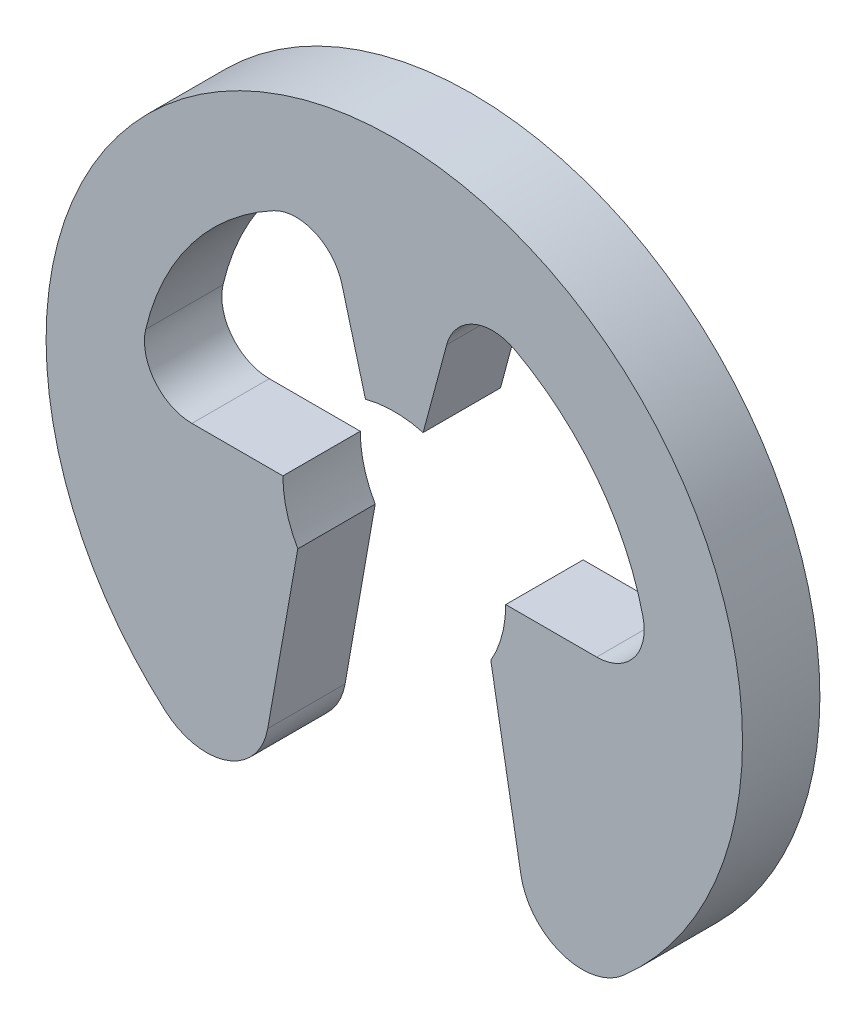
ISO-10303-21;
HEADER;
FILE_DESCRIPTION(('STEP AP214'),'2;1');
FILE_NAME('part.step','',(''),(''),'','','');
FILE_SCHEMA(('AUTOMOTIVE_DESIGN { 1 0 10303 214 1 1 1 1 }'));
ENDSEC;
DATA;
#1=APPLICATION_CONTEXT('core data for automotive mechanical design processes');
#2=APPLICATION_PROTOCOL_DEFINITION('international standard','automotive_design',2000,#1);
#3=PRODUCT_CONTEXT('',#1,'mechanical');
#4=PRODUCT('Part','Part','',(#3));
#5=PRODUCT_RELATED_PRODUCT_CATEGORY('part','',(#4));
#6=PRODUCT_DEFINITION_FORMATION('','',#4);
#7=PRODUCT_DEFINITION_CONTEXT('part definition',#1,'design');
#8=PRODUCT_DEFINITION('design','',#6,#7);
#9=PRODUCT_DEFINITION_SHAPE('','',#8);
#10=(LENGTH_UNIT() NAMED_UNIT(*) SI_UNIT(.MILLI.,.METRE.));
#11=(NAMED_UNIT(*) PLANE_ANGLE_UNIT() SI_UNIT($,.RADIAN.));
#12=(NAMED_UNIT(*) SI_UNIT($,.STERADIAN.) SOLID_ANGLE_UNIT());
#13=UNCERTAINTY_MEASURE_WITH_UNIT(LENGTH_MEASURE(1.E-05),#10,'distance_accuracy_value','');
#14=(GEOMETRIC_REPRESENTATION_CONTEXT(3) GLOBAL_UNCERTAINTY_ASSIGNED_CONTEXT((#13)) GLOBAL_UNIT_ASSIGNED_CONTEXT((#10,
#11,#12)) REPRESENTATION_CONTEXT('',''));
#15=CARTESIAN_POINT('',(0.,0.,0.));
#16=DIRECTION('',(0.,0.,1.));
#17=DIRECTION('',(1.,0.,0.));
#18=AXIS2_PLACEMENT_3D('',#15,#16,#17);
#19=CARTESIAN_POINT('',(0.653783220953245,0.15345,-0.25));
#20=DIRECTION('',(0.,0.,1.));
#21=DIRECTION('',(1.,0.,0.));
#22=AXIS2_PLACEMENT_3D('',#19,#20,#21);
#23=CYLINDRICAL_SURFACE('',#22,0.15345);
#24=CARTESIAN_POINT('',(0.653783220953245,0.15345,0.));
#25=DIRECTION('',(0.,0.,-1.));
#26=DIRECTION('',(1.,0.,0.));
#27=AXIS2_PLACEMENT_3D('',#24,#25,#26);
#28=CIRCLE('',#27,0.15345);
#29=CARTESIAN_POINT('',(0.803173490114552,0.188513513513514,0.));
#30=VERTEX_POINT('',#29);
#31=CARTESIAN_POINT('',(0.653783220953245,0.,0.));
#32=VERTEX_POINT('',#31);
#33=EDGE_CURVE('E189',#30,#32,#28,.T.);
#34=ORIENTED_EDGE('',*,*,#33,.F.);
#35=DIRECTION('',(0.,0.,1.));
#36=VECTOR('',#35,1.);
#37=CARTESIAN_POINT('',(0.803173490114552,0.188513513513514,-0.25));
#38=LINE('',#37,#36);
#39=CARTESIAN_POINT('',(0.803173490114552,0.188513513513514,-0.25));
#40=VERTEX_POINT('',#39);
#41=EDGE_CURVE('E11',#40,#30,#38,.T.);
#42=ORIENTED_EDGE('',*,*,#41,.F.);
#43=CARTESIAN_POINT('',(0.653783220953245,0.15345,-0.25));
#44=DIRECTION('',(0.,0.,-1.));
#45=DIRECTION('',(1.,0.,0.));
#46=AXIS2_PLACEMENT_3D('',#43,#44,#45);
#47=CIRCLE('',#46,0.15345);
#48=CARTESIAN_POINT('',(0.653783220953245,0.,-0.25));
#49=VERTEX_POINT('',#48);
#50=EDGE_CURVE('E239',#40,#49,#47,.T.);
#51=ORIENTED_EDGE('',*,*,#50,.T.);
#52=DIRECTION('',(0.,0.,1.));
#53=VECTOR('',#52,1.);
#54=CARTESIAN_POINT('',(0.653783220953245,0.,-0.25));
#55=LINE('',#54,#53);
#56=EDGE_CURVE('E35',#49,#32,#55,.T.);
#57=ORIENTED_EDGE('',*,*,#56,.T.);
#58=EDGE_LOOP('',(#34,#42,#51,#57));
#59=FACE_BOUND('',#58,.T.);
#60=ADVANCED_FACE('F32',(#59),#23,.F.);
#61=CARTESIAN_POINT('',(0.,0.,-0.25));
#62=DIRECTION('',(0.,0.,1.));
#63=DIRECTION('',(1.,0.,0.));
#64=AXIS2_PLACEMENT_3D('',#61,#62,#63);
#65=CYLINDRICAL_SURFACE('',#64,0.825);
#66=CARTESIAN_POINT('',(0.,0.,0.));
#67=DIRECTION('',(0.,0.,-1.));
#68=DIRECTION('',(1.,0.,0.));
#69=AXIS2_PLACEMENT_3D('',#66,#67,#68);
#70=CIRCLE('',#69,0.825);
#71=CARTESIAN_POINT('',(0.389966667070304,0.727015129535885,0.));
#72=VERTEX_POINT('',#71);
#73=EDGE_CURVE('E237',#72,#30,#70,.T.);
#74=ORIENTED_EDGE('',*,*,#73,.F.);
#75=DIRECTION('',(0.,0.,1.));
#76=VECTOR('',#75,1.);
#77=CARTESIAN_POINT('',(0.389966667070304,0.727015129535885,-0.25));
#78=LINE('',#77,#76);
#79=CARTESIAN_POINT('',(0.389966667070304,0.727015129535885,-0.25));
#80=VERTEX_POINT('',#79);
#81=EDGE_CURVE('E41',#80,#72,#78,.T.);
#82=ORIENTED_EDGE('',*,*,#81,.F.);
#83=CARTESIAN_POINT('',(0.,0.,-0.25));
#84=DIRECTION('',(0.,0.,-1.));
#85=DIRECTION('',(1.,0.,0.));
#86=AXIS2_PLACEMENT_3D('',#83,#84,#85);
#87=CIRCLE('',#86,0.825);
#88=EDGE_CURVE('E179',#80,#40,#87,.T.);
#89=ORIENTED_EDGE('',*,*,#88,.T.);
#90=ORIENTED_EDGE('',*,*,#41,.T.);
#91=EDGE_LOOP('',(#74,#82,#89,#90));
#92=FACE_BOUND('',#91,.T.);
#93=ADVANCED_FACE('F271',(#92),#65,.F.);
#94=CARTESIAN_POINT('',(0.317432866995227,0.591790315442209,-0.25));
#95=DIRECTION('',(0.,0.,1.));
#96=DIRECTION('',(1.,0.,0.));
#97=AXIS2_PLACEMENT_3D('',#94,#95,#96);
#98=CYLINDRICAL_SURFACE('',#97,0.153450000000001);
#99=CARTESIAN_POINT('',(0.317432866995227,0.591790315442209,0.));
#100=DIRECTION('',(0.,0.,-1.));
#101=DIRECTION('',(1.,0.,0.));
#102=AXIS2_PLACEMENT_3D('',#99,#100,#101);
#103=CIRCLE('',#102,0.153450000000001);
#104=CARTESIAN_POINT('',(0.169211548951169,0.63150609791319,0.));
#105=VERTEX_POINT('',#104);
#106=EDGE_CURVE('E166',#105,#72,#103,.T.);
#107=ORIENTED_EDGE('',*,*,#106,.F.);
#108=DIRECTION('',(0.,0.,1.));
#109=VECTOR('',#108,1.);
#110=CARTESIAN_POINT('',(0.169211548951169,0.63150609791319,-0.25));
#111=LINE('',#110,#109);
#112=CARTESIAN_POINT('',(0.169211548951169,0.63150609791319,-0.25));
#113=VERTEX_POINT('',#112);
#114=EDGE_CURVE('E161',#113,#105,#111,.T.);
#115=ORIENTED_EDGE('',*,*,#114,.F.);
#116=CARTESIAN_POINT('',(0.317432866995227,0.591790315442209,-0.25));
#117=DIRECTION('',(0.,0.,-1.));
#118=DIRECTION('',(1.,0.,0.));
#119=AXIS2_PLACEMENT_3D('',#116,#117,#118);
#120=CIRCLE('',#119,0.153450000000001);
#121=EDGE_CURVE('E164',#113,#80,#120,.T.);
#122=ORIENTED_EDGE('',*,*,#121,.T.);
#123=ORIENTED_EDGE('',*,*,#81,.T.);
#124=EDGE_LOOP('',(#107,#115,#122,#123));
#125=FACE_BOUND('',#124,.T.);
#126=ADVANCED_FACE('F163',(#125),#98,.F.);
#127=CARTESIAN_POINT('',(0.0931748562369079,0.347733297464065,-0.25));
#128=DIRECTION('',(0.965925826289068,-0.258819045102522,0.));
#129=DIRECTION('',(0.258819045102522,0.965925826289068,0.));
#130=AXIS2_PLACEMENT_3D('',#127,#128,#129);
#131=PLANE('',#130);
#132=DIRECTION('',(0.258819045102522,0.965925826289068,0.));
#133=VECTOR('',#132,1.);
#134=CARTESIAN_POINT('',(0.0931748562369079,0.347733297464065,0.));
#135=LINE('',#134,#133);
#136=CARTESIAN_POINT('',(0.0931748562369079,0.347733297464065,0.));
#137=VERTEX_POINT('',#136);
#138=EDGE_CURVE('E234',#137,#105,#135,.T.);
#139=ORIENTED_EDGE('',*,*,#138,.F.);
#140=DIRECTION('',(0.,0.,1.));
#141=VECTOR('',#140,1.);
#142=CARTESIAN_POINT('',(0.0931748562369079,0.347733297464065,-0.25));
#143=LINE('',#142,#141);
#144=CARTESIAN_POINT('',(0.0931748562369079,0.347733297464065,-0.25));
#145=VERTEX_POINT('',#144);
#146=EDGE_CURVE('E171',#145,#137,#143,.T.);
#147=ORIENTED_EDGE('',*,*,#146,.F.);
#148=DIRECTION('',(0.258819045102522,0.965925826289068,0.));
#149=VECTOR('',#148,1.);
#150=CARTESIAN_POINT('',(0.0931748562369079,0.347733297464065,-0.25));
#151=LINE('',#150,#149);
#152=EDGE_CURVE('E177',#145,#113,#151,.T.);
#153=ORIENTED_EDGE('',*,*,#152,.T.);
#154=ORIENTED_EDGE('',*,*,#114,.T.);
#155=EDGE_LOOP('',(#139,#147,#153,#154));
#156=FACE_BOUND('',#155,.T.);
#157=ADVANCED_FACE('F181',(#156),#131,.T.);
#158=CARTESIAN_POINT('',(0.,0.,-0.25));
#159=DIRECTION('',(0.,0.,1.));
#160=DIRECTION('',(1.,0.,0.));
#161=AXIS2_PLACEMENT_3D('',#158,#159,#160);
#162=CYLINDRICAL_SURFACE('',#161,0.36);
#163=CARTESIAN_POINT('',(0.,0.,0.));
#164=DIRECTION('',(0.,0.,-1.));
#165=DIRECTION('',(-1.,0.,0.));
#166=AXIS2_PLACEMENT_3D('',#163,#164,#165);
#167=CIRCLE('',#166,0.36);
#168=CARTESIAN_POINT('',(-0.0931748562369079,0.347733297464065,0.));
#169=VERTEX_POINT('',#168);
#170=EDGE_CURVE('E231',#169,#137,#167,.T.);
#171=ORIENTED_EDGE('',*,*,#170,.F.);
#172=DIRECTION('',(0.,0.,1.));
#173=VECTOR('',#172,1.);
#174=CARTESIAN_POINT('',(-0.0931748562369079,0.347733297464065,-0.25));
#175=LINE('',#174,#173);
#176=CARTESIAN_POINT('',(-0.0931748562369079,0.347733297464065,-0.25));
#177=VERTEX_POINT('',#176);
#178=EDGE_CURVE('E243',#177,#169,#175,.T.);
#179=ORIENTED_EDGE('',*,*,#178,.F.);
#180=CARTESIAN_POINT('',(0.,0.,-0.25));
#181=DIRECTION('',(0.,0.,-1.));
#182=DIRECTION('',(-1.,0.,0.));
#183=AXIS2_PLACEMENT_3D('',#180,#181,#182);
#184=CIRCLE('',#183,0.36);
#185=EDGE_CURVE('E182',#177,#145,#184,.T.);
#186=ORIENTED_EDGE('',*,*,#185,.T.);
#187=ORIENTED_EDGE('',*,*,#146,.T.);
#188=EDGE_LOOP('',(#171,#179,#186,#187));
#189=FACE_BOUND('',#188,.T.);
#190=ADVANCED_FACE('F284',(#189),#162,.F.);
#191=CARTESIAN_POINT('',(-0.0931748562369079,0.347733297464065,-0.25));
#192=DIRECTION('',(-0.965925826289068,-0.258819045102522,0.));
#193=DIRECTION('',(0.258819045102522,-0.965925826289068,0.));
#194=AXIS2_PLACEMENT_3D('',#191,#192,#193);
#195=PLANE('',#194);
#196=DIRECTION('',(0.258819045102522,-0.965925826289068,0.));
#197=VECTOR('',#196,1.);
#198=CARTESIAN_POINT('',(-0.0931748562369079,0.347733297464065,0.));
#199=LINE('',#198,#197);
#200=CARTESIAN_POINT('',(-0.16921154895117,0.63150609791319,0.));
#201=VERTEX_POINT('',#200);
#202=EDGE_CURVE('E228',#201,#169,#199,.T.);
#203=ORIENTED_EDGE('',*,*,#202,.F.);
#204=DIRECTION('',(0.,0.,1.));
#205=VECTOR('',#204,1.);
#206=CARTESIAN_POINT('',(-0.16921154895117,0.63150609791319,-0.25));
#207=LINE('',#206,#205);
#208=CARTESIAN_POINT('',(-0.16921154895117,0.63150609791319,-0.25));
#209=VERTEX_POINT('',#208);
#210=EDGE_CURVE('E245',#209,#201,#207,.T.);
#211=ORIENTED_EDGE('',*,*,#210,.F.);
#212=DIRECTION('',(0.258819045102522,-0.965925826289068,0.));
#213=VECTOR('',#212,1.);
#214=CARTESIAN_POINT('',(-0.0931748562369079,0.347733297464065,-0.25));
#215=LINE('',#214,#213);
#216=EDGE_CURVE('E184',#209,#177,#215,.T.);
#217=ORIENTED_EDGE('',*,*,#216,.T.);
#218=ORIENTED_EDGE('',*,*,#178,.T.);
#219=EDGE_LOOP('',(#203,#211,#217,#218));
#220=FACE_BOUND('',#219,.T.);
#221=ADVANCED_FACE('F287',(#220),#195,.T.);
#222=CARTESIAN_POINT('',(-0.317432866995227,0.591790315442209,-0.25));
#223=DIRECTION('',(0.,0.,1.));
#224=DIRECTION('',(1.,0.,0.));
#225=AXIS2_PLACEMENT_3D('',#222,#223,#224);
#226=CYLINDRICAL_SURFACE('',#225,0.153450000000001);
#227=CARTESIAN_POINT('',(-0.317432866995227,0.591790315442209,0.));
#228=DIRECTION('',(0.,0.,-1.));
#229=DIRECTION('',(1.,0.,0.));
#230=AXIS2_PLACEMENT_3D('',#227,#228,#229);
#231=CIRCLE('',#230,0.153450000000001);
#232=CARTESIAN_POINT('',(-0.389966667070303,0.727015129535884,0.));
#233=VERTEX_POINT('',#232);
#234=EDGE_CURVE('E225',#233,#201,#231,.T.);
#235=ORIENTED_EDGE('',*,*,#234,.F.);
#236=DIRECTION('',(0.,0.,1.));
#237=VECTOR('',#236,1.);
#238=CARTESIAN_POINT('',(-0.389966667070303,0.727015129535884,-0.25));
#239=LINE('',#238,#237);
#240=CARTESIAN_POINT('',(-0.389966667070303,0.727015129535884,-0.25));
#241=VERTEX_POINT('',#240);
#242=EDGE_CURVE('E247',#241,#233,#239,.T.);
#243=ORIENTED_EDGE('',*,*,#242,.F.);
#244=CARTESIAN_POINT('',(-0.317432866995227,0.591790315442209,-0.25));
#245=DIRECTION('',(0.,0.,-1.));
#246=DIRECTION('',(1.,0.,0.));
#247=AXIS2_PLACEMENT_3D('',#244,#245,#246);
#248=CIRCLE('',#247,0.153450000000001);
#249=EDGE_CURVE('E495',#241,#209,#248,.T.);
#250=ORIENTED_EDGE('',*,*,#249,.T.);
#251=ORIENTED_EDGE('',*,*,#210,.T.);
#252=EDGE_LOOP('',(#235,#243,#250,#251));
#253=FACE_BOUND('',#252,.T.);
#254=ADVANCED_FACE('F291',(#253),#226,.F.);
#255=CARTESIAN_POINT('',(0.,0.,-0.25));
#256=DIRECTION('',(0.,0.,1.));
#257=DIRECTION('',(1.,0.,0.));
#258=AXIS2_PLACEMENT_3D('',#255,#256,#257);
#259=CYLINDRICAL_SURFACE('',#258,0.824999999999999);
#260=CARTESIAN_POINT('',(0.,0.,0.));
#261=DIRECTION('',(0.,0.,-1.));
#262=DIRECTION('',(1.,0.,0.));
#263=AXIS2_PLACEMENT_3D('',#260,#261,#262);
#264=CIRCLE('',#263,0.824999999999999);
#265=CARTESIAN_POINT('',(-0.803173490114551,0.188513513513514,0.));
#266=VERTEX_POINT('',#265);
#267=EDGE_CURVE('E222',#266,#233,#264,.T.);
#268=ORIENTED_EDGE('',*,*,#267,.F.);
#269=DIRECTION('',(0.,0.,1.));
#270=VECTOR('',#269,1.);
#271=CARTESIAN_POINT('',(-0.803173490114551,0.188513513513514,-0.25));
#272=LINE('',#271,#270);
#273=CARTESIAN_POINT('',(-0.803173490114551,0.188513513513514,-0.25));
#274=VERTEX_POINT('',#273);
#275=EDGE_CURVE('E249',#274,#266,#272,.T.);
#276=ORIENTED_EDGE('',*,*,#275,.F.);
#277=CARTESIAN_POINT('',(0.,0.,-0.25));
#278=DIRECTION('',(0.,0.,-1.));
#279=DIRECTION('',(1.,0.,0.));
#280=AXIS2_PLACEMENT_3D('',#277,#278,#279);
#281=CIRCLE('',#280,0.824999999999999);
#282=EDGE_CURVE('E499',#274,#241,#281,.T.);
#283=ORIENTED_EDGE('',*,*,#282,.T.);
#284=ORIENTED_EDGE('',*,*,#242,.T.);
#285=EDGE_LOOP('',(#268,#276,#283,#284));
#286=FACE_BOUND('',#285,.T.);
#287=ADVANCED_FACE('F295',(#286),#259,.F.);
#288=CARTESIAN_POINT('',(-0.653783220953245,0.153450000000001,-0.25));
#289=DIRECTION('',(0.,0.,1.));
#290=DIRECTION('',(1.,0.,0.));
#291=AXIS2_PLACEMENT_3D('',#288,#289,#290);
#292=CYLINDRICAL_SURFACE('',#291,0.15345);
#293=CARTESIAN_POINT('',(-0.653783220953245,0.153450000000001,0.));
#294=DIRECTION('',(0.,0.,-1.));
#295=DIRECTION('',(1.,0.,0.));
#296=AXIS2_PLACEMENT_3D('',#293,#294,#295);
#297=CIRCLE('',#296,0.15345);
#298=CARTESIAN_POINT('',(-0.653783220953245,0.,0.));
#299=VERTEX_POINT('',#298);
#300=EDGE_CURVE('E219',#299,#266,#297,.T.);
#301=ORIENTED_EDGE('',*,*,#300,.F.);
#302=DIRECTION('',(0.,0.,1.));
#303=VECTOR('',#302,1.);
#304=CARTESIAN_POINT('',(-0.653783220953245,0.,-0.25));
#305=LINE('',#304,#303);
#306=CARTESIAN_POINT('',(-0.653783220953245,0.,-0.25));
#307=VERTEX_POINT('',#306);
#308=EDGE_CURVE('E251',#307,#299,#305,.T.);
#309=ORIENTED_EDGE('',*,*,#308,.F.);
#310=CARTESIAN_POINT('',(-0.653783220953245,0.153450000000001,-0.25));
#311=DIRECTION('',(0.,0.,-1.));
#312=DIRECTION('',(1.,0.,0.));
#313=AXIS2_PLACEMENT_3D('',#310,#311,#312);
#314=CIRCLE('',#313,0.15345);
#315=EDGE_CURVE('E488',#307,#274,#314,.T.);
#316=ORIENTED_EDGE('',*,*,#315,.T.);
#317=ORIENTED_EDGE('',*,*,#275,.T.);
#318=EDGE_LOOP('',(#301,#309,#316,#317));
#319=FACE_BOUND('',#318,.T.);
#320=ADVANCED_FACE('F299',(#319),#292,.F.);
#321=CARTESIAN_POINT('',(-0.36,0.,-0.25));
#322=DIRECTION('',(0.,1.,0.));
#323=DIRECTION('',(0.,0.,1.));
#324=AXIS2_PLACEMENT_3D('',#321,#322,#323);
#325=PLANE('',#324);
#326=DIRECTION('',(-1.,0.,0.));
#327=VECTOR('',#326,1.);
#328=CARTESIAN_POINT('',(-0.36,0.,0.));
#329=LINE('',#328,#327);
#330=CARTESIAN_POINT('',(-0.36,0.,0.));
#331=VERTEX_POINT('',#330);
#332=EDGE_CURVE('E216',#331,#299,#329,.T.);
#333=ORIENTED_EDGE('',*,*,#332,.F.);
#334=DIRECTION('',(0.,0.,1.));
#335=VECTOR('',#334,1.);
#336=CARTESIAN_POINT('',(-0.36,0.,-0.25));
#337=LINE('',#336,#335);
#338=CARTESIAN_POINT('',(-0.36,0.,-0.25));
#339=VERTEX_POINT('',#338);
#340=EDGE_CURVE('E253',#339,#331,#337,.T.);
#341=ORIENTED_EDGE('',*,*,#340,.F.);
#342=DIRECTION('',(-1.,0.,0.));
#343=VECTOR('',#342,1.);
#344=CARTESIAN_POINT('',(-0.36,0.,-0.25));
#345=LINE('',#344,#343);
#346=EDGE_CURVE('E484',#339,#307,#345,.T.);
#347=ORIENTED_EDGE('',*,*,#346,.T.);
#348=ORIENTED_EDGE('',*,*,#308,.T.);
#349=EDGE_LOOP('',(#333,#341,#347,#348));
#350=FACE_BOUND('',#349,.T.);
#351=ADVANCED_FACE('F303',(#350),#325,.T.);
#352=CARTESIAN_POINT('',(0.,0.,-0.25));
#353=DIRECTION('',(0.,0.,1.));
#354=DIRECTION('',(1.,0.,0.));
#355=AXIS2_PLACEMENT_3D('',#352,#353,#354);
#356=CYLINDRICAL_SURFACE('',#355,0.36);
#357=CARTESIAN_POINT('',(0.,0.,0.));
#358=DIRECTION('',(0.,0.,-1.));
#359=DIRECTION('',(1.,0.,0.));
#360=AXIS2_PLACEMENT_3D('',#357,#358,#359);
#361=CIRCLE('',#360,0.36);
#362=CARTESIAN_POINT('',(-0.311769145362398,-0.18,0.));
#363=VERTEX_POINT('',#362);
#364=EDGE_CURVE('E213',#363,#331,#361,.T.);
#365=ORIENTED_EDGE('',*,*,#364,.F.);
#366=DIRECTION('',(0.,0.,1.));
#367=VECTOR('',#366,1.);
#368=CARTESIAN_POINT('',(-0.311769145362398,-0.18,-0.25));
#369=LINE('',#368,#367);
#370=CARTESIAN_POINT('',(-0.311769145362398,-0.18,-0.25));
#371=VERTEX_POINT('',#370);
#372=EDGE_CURVE('E255',#371,#363,#369,.T.);
#373=ORIENTED_EDGE('',*,*,#372,.F.);
#374=CARTESIAN_POINT('',(0.,0.,-0.25));
#375=DIRECTION('',(0.,0.,-1.));
#376=DIRECTION('',(1.,0.,0.));
#377=AXIS2_PLACEMENT_3D('',#374,#375,#376);
#378=CIRCLE('',#377,0.36);
#379=EDGE_CURVE('E505',#371,#339,#378,.T.);
#380=ORIENTED_EDGE('',*,*,#379,.T.);
#381=ORIENTED_EDGE('',*,*,#340,.T.);
#382=EDGE_LOOP('',(#365,#373,#380,#381));
#383=FACE_BOUND('',#382,.T.);
#384=ADVANCED_FACE('F307',(#383),#356,.F.);
#385=CARTESIAN_POINT('',(-0.311769145362397,-0.18,-0.25));
#386=DIRECTION('',(0.984807753012208,-0.17364817766693,0.));
#387=DIRECTION('',(0.17364817766693,0.984807753012208,0.));
#388=AXIS2_PLACEMENT_3D('',#385,#386,#387);
#389=PLANE('',#388);
#390=DIRECTION('',(0.17364817766693,0.984807753012208,0.));
#391=VECTOR('',#390,1.);
#392=CARTESIAN_POINT('',(-0.311769145362397,-0.18,0.));
#393=LINE('',#392,#391);
#394=CARTESIAN_POINT('',(-0.409027602164805,-0.731580117867572,0.));
#395=VERTEX_POINT('',#394);
#396=EDGE_CURVE('E210',#395,#363,#393,.T.);
#397=ORIENTED_EDGE('',*,*,#396,.F.);
#398=DIRECTION('',(0.,0.,1.));
#399=VECTOR('',#398,1.);
#400=CARTESIAN_POINT('',(-0.409027602164805,-0.731580117867572,-0.25));
#401=LINE('',#400,#399);
#402=CARTESIAN_POINT('',(-0.409027602164805,-0.731580117867572,-0.25));
#403=VERTEX_POINT('',#402);
#404=EDGE_CURVE('E257',#403,#395,#401,.T.);
#405=ORIENTED_EDGE('',*,*,#404,.F.);
#406=DIRECTION('',(0.17364817766693,0.984807753012208,0.));
#407=VECTOR('',#406,1.);
#408=CARTESIAN_POINT('',(-0.311769145362397,-0.18,-0.25));
#409=LINE('',#408,#407);
#410=EDGE_CURVE('E477',#403,#371,#409,.T.);
#411=ORIENTED_EDGE('',*,*,#410,.T.);
#412=ORIENTED_EDGE('',*,*,#372,.T.);
#413=EDGE_LOOP('',(#397,#405,#411,#412));
#414=FACE_BOUND('',#413,.T.);
#415=ADVANCED_FACE('F311',(#414),#389,.T.);
#416=CARTESIAN_POINT('',(-0.606973960520261,-0.696676834156518,-0.25));
#417=DIRECTION('',(0.,0.,1.));
#418=DIRECTION('',(1.,0.,0.));
#419=AXIS2_PLACEMENT_3D('',#416,#417,#418);
#420=CYLINDRICAL_SURFACE('',#419,0.201000000000001);
#421=CARTESIAN_POINT('',(-0.606973960520261,-0.696676834156518,0.));
#422=DIRECTION('',(0.,0.,1.));
#423=DIRECTION('',(1.,0.,0.));
#424=AXIS2_PLACEMENT_3D('',#421,#422,#423);
#425=CIRCLE('',#424,0.201000000000001);
#426=CARTESIAN_POINT('',(-0.739010503880188,-0.848226664963294,0.));
#427=VERTEX_POINT('',#426);
#428=EDGE_CURVE('E207',#427,#395,#425,.T.);
#429=ORIENTED_EDGE('',*,*,#428,.F.);
#430=DIRECTION('',(0.,0.,1.));
#431=VECTOR('',#430,1.);
#432=CARTESIAN_POINT('',(-0.739010503880188,-0.848226664963294,-0.25));
#433=LINE('',#432,#431);
#434=CARTESIAN_POINT('',(-0.739010503880188,-0.848226664963294,-0.25));
#435=VERTEX_POINT('',#434);
#436=EDGE_CURVE('E259',#435,#427,#433,.T.);
#437=ORIENTED_EDGE('',*,*,#436,.F.);
#438=CARTESIAN_POINT('',(-0.606973960520261,-0.696676834156518,-0.25));
#439=DIRECTION('',(0.,0.,1.));
#440=DIRECTION('',(1.,0.,0.));
#441=AXIS2_PLACEMENT_3D('',#438,#439,#440);
#442=CIRCLE('',#441,0.201000000000001);
#443=EDGE_CURVE('E473',#435,#403,#442,.T.);
#444=ORIENTED_EDGE('',*,*,#443,.T.);
#445=ORIENTED_EDGE('',*,*,#404,.T.);
#446=EDGE_LOOP('',(#429,#437,#444,#445));
#447=FACE_BOUND('',#446,.T.);
#448=ADVANCED_FACE('F315',(#447),#420,.T.);
#449=CARTESIAN_POINT('',(0.,0.,-0.25));
#450=DIRECTION('',(0.,0.,1.));
#451=DIRECTION('',(1.,0.,0.));
#452=AXIS2_PLACEMENT_3D('',#449,#450,#451);
#453=CYLINDRICAL_SURFACE('',#452,1.125);
#454=CARTESIAN_POINT('',(0.,0.,0.));
#455=DIRECTION('',(0.,0.,1.));
#456=DIRECTION('',(1.,0.,0.));
#457=AXIS2_PLACEMENT_3D('',#454,#455,#456);
#458=CIRCLE('',#457,1.125);
#459=CARTESIAN_POINT('',(0.739010503880187,-0.848226664963294,0.));
#460=VERTEX_POINT('',#459);
#461=EDGE_CURVE('E204',#460,#427,#458,.T.);
#462=ORIENTED_EDGE('',*,*,#461,.F.);
#463=DIRECTION('',(0.,0.,1.));
#464=VECTOR('',#463,1.);
#465=CARTESIAN_POINT('',(0.739010503880187,-0.848226664963294,-0.25));
#466=LINE('',#465,#464);
#467=CARTESIAN_POINT('',(0.739010503880187,-0.848226664963294,-0.25));
#468=VERTEX_POINT('',#467);
#469=EDGE_CURVE('E261',#468,#460,#466,.T.);
#470=ORIENTED_EDGE('',*,*,#469,.F.);
#471=CARTESIAN_POINT('',(0.,0.,-0.25));
#472=DIRECTION('',(0.,0.,1.));
#473=DIRECTION('',(1.,0.,0.));
#474=AXIS2_PLACEMENT_3D('',#471,#472,#473);
#475=CIRCLE('',#474,1.125);
#476=EDGE_CURVE('E509',#468,#435,#475,.T.);
#477=ORIENTED_EDGE('',*,*,#476,.T.);
#478=ORIENTED_EDGE('',*,*,#436,.T.);
#479=EDGE_LOOP('',(#462,#470,#477,#478));
#480=FACE_BOUND('',#479,.T.);
#481=ADVANCED_FACE('F319',(#480),#453,.T.);
#482=CARTESIAN_POINT('',(0.606973960520261,-0.696676834156518,-0.25));
#483=DIRECTION('',(0.,0.,1.));
#484=DIRECTION('',(1.,0.,0.));
#485=AXIS2_PLACEMENT_3D('',#482,#483,#484);
#486=CYLINDRICAL_SURFACE('',#485,0.201000000000001);
#487=CARTESIAN_POINT('',(0.606973960520261,-0.696676834156518,0.));
#488=DIRECTION('',(0.,0.,1.));
#489=DIRECTION('',(1.,0.,0.));
#490=AXIS2_PLACEMENT_3D('',#487,#488,#489);
#491=CIRCLE('',#490,0.201000000000001);
#492=CARTESIAN_POINT('',(0.409027602164806,-0.731580117867572,0.));
#493=VERTEX_POINT('',#492);
#494=EDGE_CURVE('E201',#493,#460,#491,.T.);
#495=ORIENTED_EDGE('',*,*,#494,.F.);
#496=DIRECTION('',(0.,0.,1.));
#497=VECTOR('',#496,1.);
#498=CARTESIAN_POINT('',(0.409027602164806,-0.731580117867572,-0.25));
#499=LINE('',#498,#497);
#500=CARTESIAN_POINT('',(0.409027602164806,-0.731580117867572,-0.25));
#501=VERTEX_POINT('',#500);
#502=EDGE_CURVE('E263',#501,#493,#499,.T.);
#503=ORIENTED_EDGE('',*,*,#502,.F.);
#504=CARTESIAN_POINT('',(0.606973960520261,-0.696676834156518,-0.25));
#505=DIRECTION('',(0.,0.,1.));
#506=DIRECTION('',(1.,0.,0.));
#507=AXIS2_PLACEMENT_3D('',#504,#505,#506);
#508=CIRCLE('',#507,0.201000000000001);
#509=EDGE_CURVE('E466',#501,#468,#508,.T.);
#510=ORIENTED_EDGE('',*,*,#509,.T.);
#511=ORIENTED_EDGE('',*,*,#469,.T.);
#512=EDGE_LOOP('',(#495,#503,#510,#511));
#513=FACE_BOUND('',#512,.T.);
#514=ADVANCED_FACE('F323',(#513),#486,.T.);
#515=CARTESIAN_POINT('',(0.311769145362397,-0.18,-0.25));
#516=DIRECTION('',(-0.984807753012208,-0.17364817766693,0.));
#517=DIRECTION('',(0.17364817766693,-0.984807753012208,0.));
#518=AXIS2_PLACEMENT_3D('',#515,#516,#517);
#519=PLANE('',#518);
#520=DIRECTION('',(0.17364817766693,-0.984807753012208,0.));
#521=VECTOR('',#520,1.);
#522=CARTESIAN_POINT('',(0.311769145362397,-0.18,0.));
#523=LINE('',#522,#521);
#524=CARTESIAN_POINT('',(0.311769145362397,-0.18,0.));
#525=VERTEX_POINT('',#524);
#526=EDGE_CURVE('E198',#525,#493,#523,.T.);
#527=ORIENTED_EDGE('',*,*,#526,.F.);
#528=DIRECTION('',(0.,0.,1.));
#529=VECTOR('',#528,1.);
#530=CARTESIAN_POINT('',(0.311769145362397,-0.18,-0.25));
#531=LINE('',#530,#529);
#532=CARTESIAN_POINT('',(0.311769145362397,-0.18,-0.25));
#533=VERTEX_POINT('',#532);
#534=EDGE_CURVE('E265',#533,#525,#531,.T.);
#535=ORIENTED_EDGE('',*,*,#534,.F.);
#536=DIRECTION('',(0.17364817766693,-0.984807753012208,0.));
#537=VECTOR('',#536,1.);
#538=CARTESIAN_POINT('',(0.311769145362397,-0.18,-0.25));
#539=LINE('',#538,#537);
#540=EDGE_CURVE('E462',#533,#501,#539,.T.);
#541=ORIENTED_EDGE('',*,*,#540,.T.);
#542=ORIENTED_EDGE('',*,*,#502,.T.);
#543=EDGE_LOOP('',(#527,#535,#541,#542));
#544=FACE_BOUND('',#543,.T.);
#545=ADVANCED_FACE('F327',(#544),#519,.T.);
#546=CARTESIAN_POINT('',(0.,0.,-0.25));
#547=DIRECTION('',(0.,0.,1.));
#548=DIRECTION('',(1.,0.,0.));
#549=AXIS2_PLACEMENT_3D('',#546,#547,#548);
#550=CYLINDRICAL_SURFACE('',#549,0.36);
#551=CARTESIAN_POINT('',(0.,0.,0.));
#552=DIRECTION('',(0.,0.,-1.));
#553=DIRECTION('',(1.,0.,0.));
#554=AXIS2_PLACEMENT_3D('',#551,#552,#553);
#555=CIRCLE('',#554,0.36);
#556=CARTESIAN_POINT('',(0.36,0.,0.));
#557=VERTEX_POINT('',#556);
#558=EDGE_CURVE('E195',#557,#525,#555,.T.);
#559=ORIENTED_EDGE('',*,*,#558,.F.);
#560=DIRECTION('',(0.,0.,1.));
#561=VECTOR('',#560,1.);
#562=CARTESIAN_POINT('',(0.36,0.,-0.25));
#563=LINE('',#562,#561);
#564=CARTESIAN_POINT('',(0.36,0.,-0.25));
#565=VERTEX_POINT('',#564);
#566=EDGE_CURVE('E266',#565,#557,#563,.T.);
#567=ORIENTED_EDGE('',*,*,#566,.F.);
#568=CARTESIAN_POINT('',(0.,0.,-0.25));
#569=DIRECTION('',(0.,0.,-1.));
#570=DIRECTION('',(1.,0.,0.));
#571=AXIS2_PLACEMENT_3D('',#568,#569,#570);
#572=CIRCLE('',#571,0.36);
#573=EDGE_CURVE('E513',#565,#533,#572,.T.);
#574=ORIENTED_EDGE('',*,*,#573,.T.);
#575=ORIENTED_EDGE('',*,*,#534,.T.);
#576=EDGE_LOOP('',(#559,#567,#574,#575));
#577=FACE_BOUND('',#576,.T.);
#578=ADVANCED_FACE('F331',(#577),#550,.F.);
#579=CARTESIAN_POINT('',(0.36,0.,-0.25));
#580=DIRECTION('',(0.,1.,0.));
#581=DIRECTION('',(0.,0.,1.));
#582=AXIS2_PLACEMENT_3D('',#579,#580,#581);
#583=PLANE('',#582);
#584=DIRECTION('',(-1.,0.,0.));
#585=VECTOR('',#584,1.);
#586=CARTESIAN_POINT('',(0.36,0.,0.));
#587=LINE('',#586,#585);
#588=EDGE_CURVE('E192',#32,#557,#587,.T.);
#589=ORIENTED_EDGE('',*,*,#588,.F.);
#590=ORIENTED_EDGE('',*,*,#56,.F.);
#591=DIRECTION('',(-1.,0.,0.));
#592=VECTOR('',#591,1.);
#593=CARTESIAN_POINT('',(0.36,0.,-0.25));
#594=LINE('',#593,#592);
#595=EDGE_CURVE('E515',#49,#565,#594,.T.);
#596=ORIENTED_EDGE('',*,*,#595,.T.);
#597=ORIENTED_EDGE('',*,*,#566,.T.);
#598=EDGE_LOOP('',(#589,#590,#596,#597));
#599=FACE_BOUND('',#598,.T.);
#600=ADVANCED_FACE('F268',(#599),#583,.T.);
#601=CARTESIAN_POINT('',(0.653783220953245,0.15345,-0.25));
#602=DIRECTION('',(0.,0.,1.));
#603=DIRECTION('',(1.,0.,0.));
#604=AXIS2_PLACEMENT_3D('',#601,#602,#603);
#605=PLANE('',#604);
#606=ORIENTED_EDGE('',*,*,#50,.F.);
#607=ORIENTED_EDGE('',*,*,#88,.F.);
#608=ORIENTED_EDGE('',*,*,#121,.F.);
#609=ORIENTED_EDGE('',*,*,#152,.F.);
#610=ORIENTED_EDGE('',*,*,#185,.F.);
#611=ORIENTED_EDGE('',*,*,#216,.F.);
#612=ORIENTED_EDGE('',*,*,#249,.F.);
#613=ORIENTED_EDGE('',*,*,#282,.F.);
#614=ORIENTED_EDGE('',*,*,#315,.F.);
#615=ORIENTED_EDGE('',*,*,#346,.F.);
#616=ORIENTED_EDGE('',*,*,#379,.F.);
#617=ORIENTED_EDGE('',*,*,#410,.F.);
#618=ORIENTED_EDGE('',*,*,#443,.F.);
#619=ORIENTED_EDGE('',*,*,#476,.F.);
#620=ORIENTED_EDGE('',*,*,#509,.F.);
#621=ORIENTED_EDGE('',*,*,#540,.F.);
#622=ORIENTED_EDGE('',*,*,#573,.F.);
#623=ORIENTED_EDGE('',*,*,#595,.F.);
#624=EDGE_LOOP('',(#606,#607,#608,#609,#610,#611,#612,#613,#614,#615,#616,#617,#618,#619,#620,
#621,#622,#623));
#625=FACE_BOUND('',#624,.T.);
#626=ADVANCED_FACE('F175',(#625),#605,.F.);
#627=CARTESIAN_POINT('',(0.653783220953245,0.15345,0.));
#628=DIRECTION('',(0.,0.,1.));
#629=DIRECTION('',(1.,0.,0.));
#630=AXIS2_PLACEMENT_3D('',#627,#628,#629);
#631=PLANE('',#630);
#632=ORIENTED_EDGE('',*,*,#33,.T.);
#633=ORIENTED_EDGE('',*,*,#588,.T.);
#634=ORIENTED_EDGE('',*,*,#558,.T.);
#635=ORIENTED_EDGE('',*,*,#526,.T.);
#636=ORIENTED_EDGE('',*,*,#494,.T.);
#637=ORIENTED_EDGE('',*,*,#461,.T.);
#638=ORIENTED_EDGE('',*,*,#428,.T.);
#639=ORIENTED_EDGE('',*,*,#396,.T.);
#640=ORIENTED_EDGE('',*,*,#364,.T.);
#641=ORIENTED_EDGE('',*,*,#332,.T.);
#642=ORIENTED_EDGE('',*,*,#300,.T.);
#643=ORIENTED_EDGE('',*,*,#267,.T.);
#644=ORIENTED_EDGE('',*,*,#234,.T.);
#645=ORIENTED_EDGE('',*,*,#202,.T.);
#646=ORIENTED_EDGE('',*,*,#170,.T.);
#647=ORIENTED_EDGE('',*,*,#138,.T.);
#648=ORIENTED_EDGE('',*,*,#106,.T.);
#649=ORIENTED_EDGE('',*,*,#73,.T.);
#650=EDGE_LOOP('',(#632,#633,#634,#635,#636,#637,#638,#639,#640,#641,#642,#643,#644,#645,#646,
#647,#648,#649));
#651=FACE_BOUND('',#650,.T.);
#652=ADVANCED_FACE('F270',(#651),#631,.T.);
#653=CLOSED_SHELL('',(#60,#93,#126,#157,#190,#221,#254,#287,#320,#351,#384,#415,#448,#481,#514,
#545,#578,#600,#626,#652));
#654=MANIFOLD_SOLID_BREP('B2',#653);
#655=ADVANCED_BREP_SHAPE_REPRESENTATION('',(#18,#654),#14);
#656=SHAPE_DEFINITION_REPRESENTATION(#9,#655);
ENDSEC;
END-ISO-10303-21;
